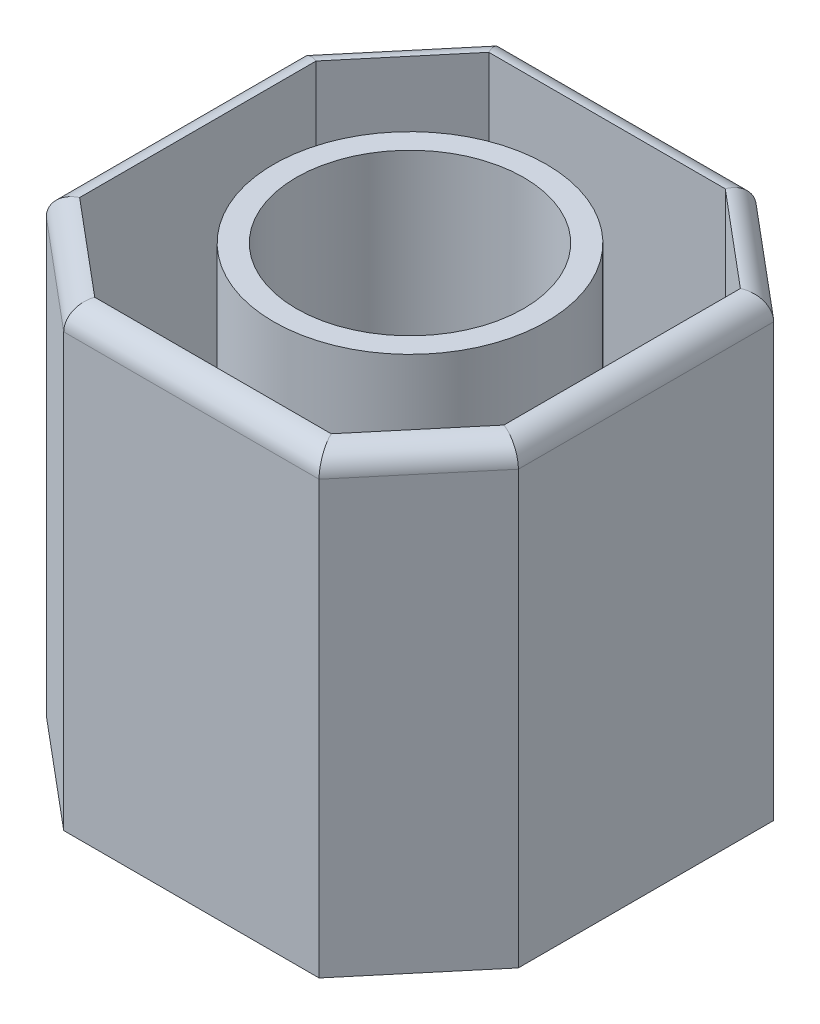
ISO-10303-21;
HEADER;
FILE_DESCRIPTION(('STEP AP214'),'2;1');
FILE_NAME('part.step','',(''),(''),'','','');
FILE_SCHEMA(('AUTOMOTIVE_DESIGN { 1 0 10303 214 1 1 1 1 }'));
ENDSEC;
DATA;
#1=APPLICATION_CONTEXT('core data for automotive mechanical design processes');
#2=APPLICATION_PROTOCOL_DEFINITION('international standard','automotive_design',2000,#1);
#3=PRODUCT_CONTEXT('',#1,'mechanical');
#4=PRODUCT('Part','Part','',(#3));
#5=PRODUCT_RELATED_PRODUCT_CATEGORY('part','',(#4));
#6=PRODUCT_DEFINITION_FORMATION('','',#4);
#7=PRODUCT_DEFINITION_CONTEXT('part definition',#1,'design');
#8=PRODUCT_DEFINITION('design','',#6,#7);
#9=PRODUCT_DEFINITION_SHAPE('','',#8);
#10=(LENGTH_UNIT() NAMED_UNIT(*) SI_UNIT(.MILLI.,.METRE.));
#11=(NAMED_UNIT(*) PLANE_ANGLE_UNIT() SI_UNIT($,.RADIAN.));
#12=(NAMED_UNIT(*) SI_UNIT($,.STERADIAN.) SOLID_ANGLE_UNIT());
#13=UNCERTAINTY_MEASURE_WITH_UNIT(LENGTH_MEASURE(1.E-05),#10,'distance_accuracy_value','');
#14=(GEOMETRIC_REPRESENTATION_CONTEXT(3) GLOBAL_UNCERTAINTY_ASSIGNED_CONTEXT((#13)) GLOBAL_UNIT_ASSIGNED_CONTEXT((#10,
#11,#12)) REPRESENTATION_CONTEXT('',''));
#15=CARTESIAN_POINT('',(0.,0.,0.));
#16=DIRECTION('',(0.,0.,1.));
#17=DIRECTION('',(1.,0.,0.));
#18=AXIS2_PLACEMENT_3D('',#15,#16,#17);
#19=CARTESIAN_POINT('',(0.,10.,0.));
#20=DIRECTION('',(0.,1.,0.));
#21=DIRECTION('',(0.,0.,1.));
#22=AXIS2_PLACEMENT_3D('',#19,#20,#21);
#23=PLANE('',#22);
#24=CARTESIAN_POINT('',(0.,10.,0.));
#25=DIRECTION('',(0.,1.,0.));
#26=DIRECTION('',(0.,0.,1.));
#27=AXIS2_PLACEMENT_3D('',#24,#25,#26);
#28=CIRCLE('',#27,2.5);
#29=CARTESIAN_POINT('',(0.,10.,2.5));
#30=VERTEX_POINT('',#29);
#31=EDGE_CURVE('E218',#30,#30,#28,.T.);
#32=ORIENTED_EDGE('',*,*,#31,.F.);
#33=EDGE_LOOP('',(#32));
#34=FACE_BOUND('',#33,.T.);
#35=CARTESIAN_POINT('',(0.,10.,0.));
#36=DIRECTION('',(0.,1.,0.));
#37=DIRECTION('',(0.,0.,1.));
#38=AXIS2_PLACEMENT_3D('',#35,#36,#37);
#39=CIRCLE('',#38,3.);
#40=CARTESIAN_POINT('',(0.,10.,3.));
#41=VERTEX_POINT('',#40);
#42=EDGE_CURVE('E213',#41,#41,#39,.T.);
#43=ORIENTED_EDGE('',*,*,#42,.T.);
#44=EDGE_LOOP('',(#43));
#45=FACE_BOUND('',#44,.T.);
#46=ADVANCED_FACE('F35',(#34,#45),#23,.T.);
#47=CARTESIAN_POINT('',(0.,0.,0.));
#48=DIRECTION('',(0.,1.,0.));
#49=DIRECTION('',(0.,0.,1.));
#50=AXIS2_PLACEMENT_3D('',#47,#48,#49);
#51=PLANE('',#50);
#52=DIRECTION('',(0.,0.,1.));
#53=VECTOR('',#52,1.);
#54=CARTESIAN_POINT('',(-5.,0.,5.));
#55=LINE('',#54,#53);
#56=CARTESIAN_POINT('',(-5.,0.,-2.61649281481158));
#57=VERTEX_POINT('',#56);
#58=CARTESIAN_POINT('',(-5.,0.,2.99999999999999));
#59=VERTEX_POINT('',#58);
#60=EDGE_CURVE('E221',#57,#59,#55,.T.);
#61=ORIENTED_EDGE('',*,*,#60,.F.);
#62=DIRECTION('',(-0.642787609686541,0.,0.766044443118977));
#63=VECTOR('',#62,1.);
#64=CARTESIAN_POINT('',(-5.,0.,-2.61649281481158));
#65=LINE('',#64,#63);
#66=CARTESIAN_POINT('',(-2.99999999999999,0.,-5.));
#67=VERTEX_POINT('',#66);
#68=EDGE_CURVE('E245',#57,#67,#65,.F.);
#69=ORIENTED_EDGE('',*,*,#68,.T.);
#70=DIRECTION('',(-1.,0.,0.));
#71=VECTOR('',#70,1.);
#72=CARTESIAN_POINT('',(5.,0.,-5.));
#73=LINE('',#72,#71);
#74=CARTESIAN_POINT('',(2.61649281481158,0.,-5.));
#75=VERTEX_POINT('',#74);
#76=EDGE_CURVE('E232',#75,#67,#73,.T.);
#77=ORIENTED_EDGE('',*,*,#76,.F.);
#78=DIRECTION('',(-0.766044443118977,0.,-0.642787609686541));
#79=VECTOR('',#78,1.);
#80=CARTESIAN_POINT('',(2.61649281481158,0.,-5.));
#81=LINE('',#80,#79);
#82=CARTESIAN_POINT('',(5.,0.,-2.99999999999999));
#83=VERTEX_POINT('',#82);
#84=EDGE_CURVE('E243',#75,#83,#81,.F.);
#85=ORIENTED_EDGE('',*,*,#84,.T.);
#86=DIRECTION('',(0.,0.,-1.));
#87=VECTOR('',#86,1.);
#88=CARTESIAN_POINT('',(5.,0.,5.));
#89=LINE('',#88,#87);
#90=CARTESIAN_POINT('',(5.,0.,2.61649281481158));
#91=VERTEX_POINT('',#90);
#92=EDGE_CURVE('E229',#91,#83,#89,.T.);
#93=ORIENTED_EDGE('',*,*,#92,.F.);
#94=DIRECTION('',(0.642787609686541,0.,-0.766044443118977));
#95=VECTOR('',#94,1.);
#96=CARTESIAN_POINT('',(5.,0.,2.61649281481158));
#97=LINE('',#96,#95);
#98=CARTESIAN_POINT('',(2.99999999999999,0.,5.));
#99=VERTEX_POINT('',#98);
#100=EDGE_CURVE('E241',#91,#99,#97,.F.);
#101=ORIENTED_EDGE('',*,*,#100,.T.);
#102=DIRECTION('',(1.,0.,0.));
#103=VECTOR('',#102,1.);
#104=CARTESIAN_POINT('',(5.,0.,5.));
#105=LINE('',#104,#103);
#106=CARTESIAN_POINT('',(-2.61649281481158,0.,5.));
#107=VERTEX_POINT('',#106);
#108=EDGE_CURVE('E226',#107,#99,#105,.T.);
#109=ORIENTED_EDGE('',*,*,#108,.F.);
#110=DIRECTION('',(0.766044443118977,0.,0.642787609686541));
#111=VECTOR('',#110,1.);
#112=CARTESIAN_POINT('',(-2.61649281481158,0.,5.));
#113=LINE('',#112,#111);
#114=EDGE_CURVE('E239',#107,#59,#113,.F.);
#115=ORIENTED_EDGE('',*,*,#114,.T.);
#116=EDGE_LOOP('',(#61,#69,#77,#85,#93,#101,#109,#115));
#117=FACE_BOUND('',#116,.T.);
#118=CARTESIAN_POINT('',(0.,0.,0.));
#119=DIRECTION('',(0.,1.,0.));
#120=DIRECTION('',(0.,0.,1.));
#121=AXIS2_PLACEMENT_3D('',#118,#119,#120);
#122=CIRCLE('',#121,2.5);
#123=CARTESIAN_POINT('',(0.,0.,2.5));
#124=VERTEX_POINT('',#123);
#125=EDGE_CURVE('E197',#124,#124,#122,.T.);
#126=ORIENTED_EDGE('',*,*,#125,.T.);
#127=EDGE_LOOP('',(#126));
#128=FACE_BOUND('',#127,.T.);
#129=ADVANCED_FACE('F365',(#117,#128),#51,.F.);
#130=CARTESIAN_POINT('',(-5.,10.,5.));
#131=DIRECTION('',(1.,0.,0.));
#132=DIRECTION('',(0.,0.,-1.));
#133=AXIS2_PLACEMENT_3D('',#130,#131,#132);
#134=PLANE('',#133);
#135=DIRECTION('',(0.,1.,0.));
#136=VECTOR('',#135,1.);
#137=CARTESIAN_POINT('',(-5.,10.,2.99999999999999));
#138=LINE('',#137,#136);
#139=CARTESIAN_POINT('',(-5.,9.5,2.99999999999999));
#140=VERTEX_POINT('',#139);
#141=EDGE_CURVE('E235',#59,#140,#138,.T.);
#142=ORIENTED_EDGE('',*,*,#141,.T.);
#143=DIRECTION('',(0.,0.,1.));
#144=VECTOR('',#143,1.);
#145=CARTESIAN_POINT('',(-5.,9.5,-2.61649281481158));
#146=LINE('',#145,#144);
#147=CARTESIAN_POINT('',(-5.,9.5,-2.61649281481158));
#148=VERTEX_POINT('',#147);
#149=EDGE_CURVE('E59',#140,#148,#146,.F.);
#150=ORIENTED_EDGE('',*,*,#149,.T.);
#151=DIRECTION('',(0.,-1.,0.));
#152=VECTOR('',#151,1.);
#153=CARTESIAN_POINT('',(-5.,10.,-2.61649281481158));
#154=LINE('',#153,#152);
#155=EDGE_CURVE('E237',#148,#57,#154,.T.);
#156=ORIENTED_EDGE('',*,*,#155,.T.);
#157=ORIENTED_EDGE('',*,*,#60,.T.);
#158=EDGE_LOOP('',(#142,#150,#156,#157));
#159=FACE_BOUND('',#158,.T.);
#160=ADVANCED_FACE('F371',(#159),#134,.F.);
#161=CARTESIAN_POINT('',(5.,10.,5.));
#162=DIRECTION('',(0.,0.,-1.));
#163=DIRECTION('',(-1.,0.,0.));
#164=AXIS2_PLACEMENT_3D('',#161,#162,#163);
#165=PLANE('',#164);
#166=DIRECTION('',(0.,1.,0.));
#167=VECTOR('',#166,1.);
#168=CARTESIAN_POINT('',(2.99999999999999,10.,5.));
#169=LINE('',#168,#167);
#170=CARTESIAN_POINT('',(2.99999999999999,9.5,5.));
#171=VERTEX_POINT('',#170);
#172=EDGE_CURVE('E258',#99,#171,#169,.T.);
#173=ORIENTED_EDGE('',*,*,#172,.T.);
#174=DIRECTION('',(1.,0.,0.));
#175=VECTOR('',#174,1.);
#176=CARTESIAN_POINT('',(-2.61649281481158,9.5,5.));
#177=LINE('',#176,#175);
#178=CARTESIAN_POINT('',(-2.61649281481158,9.5,5.));
#179=VERTEX_POINT('',#178);
#180=EDGE_CURVE('E268',#171,#179,#177,.F.);
#181=ORIENTED_EDGE('',*,*,#180,.T.);
#182=DIRECTION('',(0.,-1.,0.));
#183=VECTOR('',#182,1.);
#184=CARTESIAN_POINT('',(-2.61649281481158,10.,5.));
#185=LINE('',#184,#183);
#186=EDGE_CURVE('E256',#179,#107,#185,.T.);
#187=ORIENTED_EDGE('',*,*,#186,.T.);
#188=ORIENTED_EDGE('',*,*,#108,.T.);
#189=EDGE_LOOP('',(#173,#181,#187,#188));
#190=FACE_BOUND('',#189,.T.);
#191=ADVANCED_FACE('F387',(#190),#165,.F.);
#192=CARTESIAN_POINT('',(5.,10.,5.));
#193=DIRECTION('',(-1.,0.,0.));
#194=DIRECTION('',(0.,0.,1.));
#195=AXIS2_PLACEMENT_3D('',#192,#193,#194);
#196=PLANE('',#195);
#197=DIRECTION('',(0.,1.,0.));
#198=VECTOR('',#197,1.);
#199=CARTESIAN_POINT('',(5.,10.,-2.99999999999999));
#200=LINE('',#199,#198);
#201=CARTESIAN_POINT('',(5.,9.5,-2.99999999999999));
#202=VERTEX_POINT('',#201);
#203=EDGE_CURVE('E253',#83,#202,#200,.T.);
#204=ORIENTED_EDGE('',*,*,#203,.T.);
#205=DIRECTION('',(0.,0.,-1.));
#206=VECTOR('',#205,1.);
#207=CARTESIAN_POINT('',(5.,9.5,2.61649281481158));
#208=LINE('',#207,#206);
#209=CARTESIAN_POINT('',(5.,9.5,2.61649281481158));
#210=VERTEX_POINT('',#209);
#211=EDGE_CURVE('E264',#202,#210,#208,.F.);
#212=ORIENTED_EDGE('',*,*,#211,.T.);
#213=DIRECTION('',(0.,-1.,0.));
#214=VECTOR('',#213,1.);
#215=CARTESIAN_POINT('',(5.,10.,2.61649281481158));
#216=LINE('',#215,#214);
#217=EDGE_CURVE('E251',#210,#91,#216,.T.);
#218=ORIENTED_EDGE('',*,*,#217,.T.);
#219=ORIENTED_EDGE('',*,*,#92,.T.);
#220=EDGE_LOOP('',(#204,#212,#218,#219));
#221=FACE_BOUND('',#220,.T.);
#222=ADVANCED_FACE('F383',(#221),#196,.F.);
#223=CARTESIAN_POINT('',(5.,10.,-5.));
#224=DIRECTION('',(0.,0.,1.));
#225=DIRECTION('',(1.,0.,0.));
#226=AXIS2_PLACEMENT_3D('',#223,#224,#225);
#227=PLANE('',#226);
#228=DIRECTION('',(0.,1.,0.));
#229=VECTOR('',#228,1.);
#230=CARTESIAN_POINT('',(-2.99999999999999,10.,-5.));
#231=LINE('',#230,#229);
#232=CARTESIAN_POINT('',(-2.99999999999999,9.5,-5.));
#233=VERTEX_POINT('',#232);
#234=EDGE_CURVE('E249',#67,#233,#231,.T.);
#235=ORIENTED_EDGE('',*,*,#234,.T.);
#236=DIRECTION('',(-1.,0.,0.));
#237=VECTOR('',#236,1.);
#238=CARTESIAN_POINT('',(2.61649281481158,9.5,-5.));
#239=LINE('',#238,#237);
#240=CARTESIAN_POINT('',(2.61649281481158,9.5,-5.));
#241=VERTEX_POINT('',#240);
#242=EDGE_CURVE('E11',#233,#241,#239,.F.);
#243=ORIENTED_EDGE('',*,*,#242,.T.);
#244=DIRECTION('',(0.,-1.,0.));
#245=VECTOR('',#244,1.);
#246=CARTESIAN_POINT('',(2.61649281481158,10.,-5.));
#247=LINE('',#246,#245);
#248=EDGE_CURVE('E247',#241,#75,#247,.T.);
#249=ORIENTED_EDGE('',*,*,#248,.T.);
#250=ORIENTED_EDGE('',*,*,#76,.T.);
#251=EDGE_LOOP('',(#235,#243,#249,#250));
#252=FACE_BOUND('',#251,.T.);
#253=ADVANCED_FACE('F380',(#252),#227,.F.);
#254=CARTESIAN_POINT('',(0.,10.,0.));
#255=DIRECTION('',(0.,-1.,0.));
#256=DIRECTION('',(0.,0.,-1.));
#257=AXIS2_PLACEMENT_3D('',#254,#255,#256);
#258=CYLINDRICAL_SURFACE('',#257,2.5);
#259=ORIENTED_EDGE('',*,*,#31,.T.);
#260=EDGE_LOOP('',(#259));
#261=FACE_BOUND('',#260,.T.);
#262=ORIENTED_EDGE('',*,*,#125,.F.);
#263=EDGE_LOOP('',(#262));
#264=FACE_BOUND('',#263,.T.);
#265=ADVANCED_FACE('F377',(#261,#264),#258,.F.);
#266=CARTESIAN_POINT('',(-5.,10.,-2.61649281481158));
#267=DIRECTION('',(0.766044443118977,0.,0.642787609686541));
#268=DIRECTION('',(0.,-1.,0.));
#269=AXIS2_PLACEMENT_3D('',#266,#267,#268);
#270=PLANE('',#269);
#271=ORIENTED_EDGE('',*,*,#155,.F.);
#272=DIRECTION('',(-0.642787609686541,0.,0.766044443118977));
#273=VECTOR('',#272,1.);
#274=CARTESIAN_POINT('',(-5.,9.5,-2.61649281481158));
#275=LINE('',#274,#273);
#276=EDGE_CURVE('E44',#148,#233,#275,.F.);
#277=ORIENTED_EDGE('',*,*,#276,.T.);
#278=ORIENTED_EDGE('',*,*,#234,.F.);
#279=ORIENTED_EDGE('',*,*,#68,.F.);
#280=EDGE_LOOP('',(#271,#277,#278,#279));
#281=FACE_BOUND('',#280,.T.);
#282=ADVANCED_FACE('F394',(#281),#270,.F.);
#283=CARTESIAN_POINT('',(2.61649281481158,10.,-5.));
#284=DIRECTION('',(-0.642787609686541,0.,0.766044443118977));
#285=DIRECTION('',(0.,-1.,0.));
#286=AXIS2_PLACEMENT_3D('',#283,#284,#285);
#287=PLANE('',#286);
#288=ORIENTED_EDGE('',*,*,#248,.F.);
#289=DIRECTION('',(-0.766044443118977,0.,-0.642787609686541));
#290=VECTOR('',#289,1.);
#291=CARTESIAN_POINT('',(2.61649281481158,9.5,-5.));
#292=LINE('',#291,#290);
#293=EDGE_CURVE('E261',#241,#202,#292,.F.);
#294=ORIENTED_EDGE('',*,*,#293,.T.);
#295=ORIENTED_EDGE('',*,*,#203,.F.);
#296=ORIENTED_EDGE('',*,*,#84,.F.);
#297=EDGE_LOOP('',(#288,#294,#295,#296));
#298=FACE_BOUND('',#297,.T.);
#299=ADVANCED_FACE('F397',(#298),#287,.F.);
#300=CARTESIAN_POINT('',(5.,10.,2.61649281481158));
#301=DIRECTION('',(-0.766044443118977,0.,-0.642787609686541));
#302=DIRECTION('',(0.,-1.,0.));
#303=AXIS2_PLACEMENT_3D('',#300,#301,#302);
#304=PLANE('',#303);
#305=ORIENTED_EDGE('',*,*,#217,.F.);
#306=DIRECTION('',(0.642787609686541,0.,-0.766044443118977));
#307=VECTOR('',#306,1.);
#308=CARTESIAN_POINT('',(5.,9.5,2.61649281481158));
#309=LINE('',#308,#307);
#310=EDGE_CURVE('E266',#210,#171,#309,.F.);
#311=ORIENTED_EDGE('',*,*,#310,.T.);
#312=ORIENTED_EDGE('',*,*,#172,.F.);
#313=ORIENTED_EDGE('',*,*,#100,.F.);
#314=EDGE_LOOP('',(#305,#311,#312,#313));
#315=FACE_BOUND('',#314,.T.);
#316=ADVANCED_FACE('F400',(#315),#304,.F.);
#317=CARTESIAN_POINT('',(-2.61649281481158,10.,5.));
#318=DIRECTION('',(0.642787609686541,0.,-0.766044443118977));
#319=DIRECTION('',(0.,-1.,0.));
#320=AXIS2_PLACEMENT_3D('',#317,#318,#319);
#321=PLANE('',#320);
#322=ORIENTED_EDGE('',*,*,#186,.F.);
#323=DIRECTION('',(0.766044443118977,0.,0.642787609686541));
#324=VECTOR('',#323,1.);
#325=CARTESIAN_POINT('',(-2.61649281481158,9.5,5.));
#326=LINE('',#325,#324);
#327=EDGE_CURVE('E270',#179,#140,#326,.F.);
#328=ORIENTED_EDGE('',*,*,#327,.T.);
#329=ORIENTED_EDGE('',*,*,#141,.F.);
#330=ORIENTED_EDGE('',*,*,#114,.F.);
#331=EDGE_LOOP('',(#322,#328,#329,#330));
#332=FACE_BOUND('',#331,.T.);
#333=ADVANCED_FACE('F404',(#332),#321,.F.);
#334=CARTESIAN_POINT('',(0.,0.5,0.));
#335=DIRECTION('',(0.,1.,0.));
#336=DIRECTION('',(0.,0.,1.));
#337=AXIS2_PLACEMENT_3D('',#334,#335,#336);
#338=PLANE('',#337);
#339=DIRECTION('',(0.,0.,1.));
#340=VECTOR('',#339,1.);
#341=CARTESIAN_POINT('',(-4.5,0.5,5.));
#342=LINE('',#341,#340);
#343=CARTESIAN_POINT('',(-4.5,0.5,-2.43450769767848));
#344=VERTEX_POINT('',#343);
#345=CARTESIAN_POINT('',(-4.5,0.5,2.76684617092249));
#346=VERTEX_POINT('',#345);
#347=EDGE_CURVE('E216',#344,#346,#342,.T.);
#348=ORIENTED_EDGE('',*,*,#347,.T.);
#349=DIRECTION('',(0.766044443118977,0.,0.642787609686541));
#350=VECTOR('',#349,1.);
#351=CARTESIAN_POINT('',(-2.29509900996831,0.5,4.61697777844051));
#352=LINE('',#351,#350);
#353=CARTESIAN_POINT('',(-2.43450769767848,0.5,4.5));
#354=VERTEX_POINT('',#353);
#355=EDGE_CURVE('E304',#354,#346,#352,.F.);
#356=ORIENTED_EDGE('',*,*,#355,.F.);
#357=DIRECTION('',(1.,0.,0.));
#358=VECTOR('',#357,1.);
#359=CARTESIAN_POINT('',(5.,0.5,4.5));
#360=LINE('',#359,#358);
#361=CARTESIAN_POINT('',(2.76684617092249,0.5,4.5));
#362=VERTEX_POINT('',#361);
#363=EDGE_CURVE('E325',#354,#362,#360,.T.);
#364=ORIENTED_EDGE('',*,*,#363,.T.);
#365=DIRECTION('',(0.642787609686541,0.,-0.766044443118977));
#366=VECTOR('',#365,1.);
#367=CARTESIAN_POINT('',(4.61697777844051,0.5,2.29509900996831));
#368=LINE('',#367,#366);
#369=CARTESIAN_POINT('',(4.5,0.5,2.43450769767848));
#370=VERTEX_POINT('',#369);
#371=EDGE_CURVE('E306',#370,#362,#368,.F.);
#372=ORIENTED_EDGE('',*,*,#371,.F.);
#373=DIRECTION('',(0.,0.,-1.));
#374=VECTOR('',#373,1.);
#375=CARTESIAN_POINT('',(4.5,0.5,5.));
#376=LINE('',#375,#374);
#377=CARTESIAN_POINT('',(4.5,0.5,-2.76684617092249));
#378=VERTEX_POINT('',#377);
#379=EDGE_CURVE('E172',#370,#378,#376,.T.);
#380=ORIENTED_EDGE('',*,*,#379,.T.);
#381=DIRECTION('',(-0.766044443118977,0.,-0.642787609686541));
#382=VECTOR('',#381,1.);
#383=CARTESIAN_POINT('',(2.29509900996831,0.5,-4.61697777844051));
#384=LINE('',#383,#382);
#385=CARTESIAN_POINT('',(2.43450769767848,0.5,-4.5));
#386=VERTEX_POINT('',#385);
#387=EDGE_CURVE('E161',#386,#378,#384,.F.);
#388=ORIENTED_EDGE('',*,*,#387,.F.);
#389=DIRECTION('',(-1.,0.,0.));
#390=VECTOR('',#389,1.);
#391=CARTESIAN_POINT('',(5.,0.5,-4.5));
#392=LINE('',#391,#390);
#393=CARTESIAN_POINT('',(-2.7668461709225,0.5,-4.5));
#394=VERTEX_POINT('',#393);
#395=EDGE_CURVE('E164',#386,#394,#392,.T.);
#396=ORIENTED_EDGE('',*,*,#395,.T.);
#397=DIRECTION('',(-0.642787609686541,0.,0.766044443118977));
#398=VECTOR('',#397,1.);
#399=CARTESIAN_POINT('',(-4.61697777844051,0.5,-2.29509900996831));
#400=LINE('',#399,#398);
#401=EDGE_CURVE('E149',#344,#394,#400,.F.);
#402=ORIENTED_EDGE('',*,*,#401,.F.);
#403=EDGE_LOOP('',(#348,#356,#364,#372,#380,#388,#396,#402));
#404=FACE_BOUND('',#403,.T.);
#405=CARTESIAN_POINT('',(0.,0.5,0.));
#406=DIRECTION('',(0.,1.,0.));
#407=DIRECTION('',(0.,0.,1.));
#408=AXIS2_PLACEMENT_3D('',#405,#406,#407);
#409=CIRCLE('',#408,3.);
#410=CARTESIAN_POINT('',(0.,0.5,3.));
#411=VERTEX_POINT('',#410);
#412=EDGE_CURVE('E217',#411,#411,#409,.T.);
#413=ORIENTED_EDGE('',*,*,#412,.F.);
#414=EDGE_LOOP('',(#413));
#415=FACE_BOUND('',#414,.T.);
#416=ADVANCED_FACE('F165',(#404,#415),#338,.T.);
#417=CARTESIAN_POINT('',(-4.5,10.,5.));
#418=DIRECTION('',(1.,0.,0.));
#419=DIRECTION('',(0.,0.,-1.));
#420=AXIS2_PLACEMENT_3D('',#417,#418,#419);
#421=PLANE('',#420);
#422=DIRECTION('',(0.,0.,1.));
#423=VECTOR('',#422,1.);
#424=CARTESIAN_POINT('',(-4.5,10.,5.));
#425=LINE('',#424,#423);
#426=CARTESIAN_POINT('',(-4.5,10.,-2.43450769767848));
#427=VERTEX_POINT('',#426);
#428=CARTESIAN_POINT('',(-4.5,10.,2.76684617092249));
#429=VERTEX_POINT('',#428);
#430=EDGE_CURVE('E171',#427,#429,#425,.T.);
#431=ORIENTED_EDGE('',*,*,#430,.T.);
#432=DIRECTION('',(0.,-1.,0.));
#433=VECTOR('',#432,1.);
#434=CARTESIAN_POINT('',(-4.5,10.,2.76684617092249));
#435=LINE('',#434,#433);
#436=EDGE_CURVE('E184',#346,#429,#435,.F.);
#437=ORIENTED_EDGE('',*,*,#436,.F.);
#438=ORIENTED_EDGE('',*,*,#347,.F.);
#439=DIRECTION('',(0.,1.,0.));
#440=VECTOR('',#439,1.);
#441=CARTESIAN_POINT('',(-4.5,10.,-2.43450769767848));
#442=LINE('',#441,#440);
#443=EDGE_CURVE('E156',#427,#344,#442,.F.);
#444=ORIENTED_EDGE('',*,*,#443,.F.);
#445=EDGE_LOOP('',(#431,#437,#438,#444));
#446=FACE_BOUND('',#445,.T.);
#447=ADVANCED_FACE('F313',(#446),#421,.T.);
#448=CARTESIAN_POINT('',(5.,10.,4.5));
#449=DIRECTION('',(0.,0.,-1.));
#450=DIRECTION('',(-1.,0.,0.));
#451=AXIS2_PLACEMENT_3D('',#448,#449,#450);
#452=PLANE('',#451);
#453=ORIENTED_EDGE('',*,*,#363,.F.);
#454=DIRECTION('',(0.,1.,0.));
#455=VECTOR('',#454,1.);
#456=CARTESIAN_POINT('',(-2.43450769767848,10.,4.5));
#457=LINE('',#456,#455);
#458=CARTESIAN_POINT('',(-2.43450769767848,10.,4.5));
#459=VERTEX_POINT('',#458);
#460=EDGE_CURVE('E190',#459,#354,#457,.F.);
#461=ORIENTED_EDGE('',*,*,#460,.F.);
#462=DIRECTION('',(1.,0.,0.));
#463=VECTOR('',#462,1.);
#464=CARTESIAN_POINT('',(5.,10.,4.5));
#465=LINE('',#464,#463);
#466=CARTESIAN_POINT('',(2.76684617092249,10.,4.5));
#467=VERTEX_POINT('',#466);
#468=EDGE_CURVE('E201',#459,#467,#465,.T.);
#469=ORIENTED_EDGE('',*,*,#468,.T.);
#470=DIRECTION('',(0.,-1.,0.));
#471=VECTOR('',#470,1.);
#472=CARTESIAN_POINT('',(2.76684617092249,10.,4.5));
#473=LINE('',#472,#471);
#474=EDGE_CURVE('E195',#362,#467,#473,.F.);
#475=ORIENTED_EDGE('',*,*,#474,.F.);
#476=EDGE_LOOP('',(#453,#461,#469,#475));
#477=FACE_BOUND('',#476,.T.);
#478=ADVANCED_FACE('F323',(#477),#452,.T.);
#479=CARTESIAN_POINT('',(4.5,10.,5.));
#480=DIRECTION('',(-1.,0.,0.));
#481=DIRECTION('',(0.,0.,1.));
#482=AXIS2_PLACEMENT_3D('',#479,#480,#481);
#483=PLANE('',#482);
#484=ORIENTED_EDGE('',*,*,#379,.F.);
#485=DIRECTION('',(0.,1.,0.));
#486=VECTOR('',#485,1.);
#487=CARTESIAN_POINT('',(4.5,10.,2.43450769767848));
#488=LINE('',#487,#486);
#489=CARTESIAN_POINT('',(4.5,10.,2.43450769767848));
#490=VERTEX_POINT('',#489);
#491=EDGE_CURVE('E191',#490,#370,#488,.F.);
#492=ORIENTED_EDGE('',*,*,#491,.F.);
#493=DIRECTION('',(0.,0.,-1.));
#494=VECTOR('',#493,1.);
#495=CARTESIAN_POINT('',(4.5,10.,5.));
#496=LINE('',#495,#494);
#497=CARTESIAN_POINT('',(4.5,10.,-2.76684617092249));
#498=VERTEX_POINT('',#497);
#499=EDGE_CURVE('E205',#490,#498,#496,.T.);
#500=ORIENTED_EDGE('',*,*,#499,.T.);
#501=DIRECTION('',(0.,-1.,0.));
#502=VECTOR('',#501,1.);
#503=CARTESIAN_POINT('',(4.5,10.,-2.76684617092249));
#504=LINE('',#503,#502);
#505=EDGE_CURVE('E187',#378,#498,#504,.F.);
#506=ORIENTED_EDGE('',*,*,#505,.F.);
#507=EDGE_LOOP('',(#484,#492,#500,#506));
#508=FACE_BOUND('',#507,.T.);
#509=ADVANCED_FACE('F337',(#508),#483,.T.);
#510=CARTESIAN_POINT('',(5.,10.,-4.5));
#511=DIRECTION('',(0.,0.,1.));
#512=DIRECTION('',(1.,0.,0.));
#513=AXIS2_PLACEMENT_3D('',#510,#511,#512);
#514=PLANE('',#513);
#515=ORIENTED_EDGE('',*,*,#395,.F.);
#516=DIRECTION('',(0.,1.,0.));
#517=VECTOR('',#516,1.);
#518=CARTESIAN_POINT('',(2.43450769767848,10.,-4.5));
#519=LINE('',#518,#517);
#520=CARTESIAN_POINT('',(2.43450769767848,10.,-4.5));
#521=VERTEX_POINT('',#520);
#522=EDGE_CURVE('E160',#521,#386,#519,.F.);
#523=ORIENTED_EDGE('',*,*,#522,.F.);
#524=DIRECTION('',(-1.,0.,0.));
#525=VECTOR('',#524,1.);
#526=CARTESIAN_POINT('',(5.,10.,-4.5));
#527=LINE('',#526,#525);
#528=CARTESIAN_POINT('',(-2.7668461709225,10.,-4.5));
#529=VERTEX_POINT('',#528);
#530=EDGE_CURVE('E176',#521,#529,#527,.T.);
#531=ORIENTED_EDGE('',*,*,#530,.T.);
#532=DIRECTION('',(0.,-1.,0.));
#533=VECTOR('',#532,1.);
#534=CARTESIAN_POINT('',(-2.76684617092249,10.,-4.5));
#535=LINE('',#534,#533);
#536=EDGE_CURVE('E153',#394,#529,#535,.F.);
#537=ORIENTED_EDGE('',*,*,#536,.F.);
#538=EDGE_LOOP('',(#515,#523,#531,#537));
#539=FACE_BOUND('',#538,.T.);
#540=ADVANCED_FACE('F174',(#539),#514,.T.);
#541=CARTESIAN_POINT('',(0.,10.,0.));
#542=DIRECTION('',(0.,-1.,0.));
#543=DIRECTION('',(0.,0.,-1.));
#544=AXIS2_PLACEMENT_3D('',#541,#542,#543);
#545=CYLINDRICAL_SURFACE('',#544,3.);
#546=ORIENTED_EDGE('',*,*,#42,.F.);
#547=EDGE_LOOP('',(#546));
#548=FACE_BOUND('',#547,.T.);
#549=ORIENTED_EDGE('',*,*,#412,.T.);
#550=EDGE_LOOP('',(#549));
#551=FACE_BOUND('',#550,.T.);
#552=ADVANCED_FACE('F489',(#548,#551),#545,.T.);
#553=CARTESIAN_POINT('',(-4.61697777844051,10.,-2.29509900996831));
#554=DIRECTION('',(0.766044443118977,0.,0.642787609686541));
#555=DIRECTION('',(0.,-1.,0.));
#556=AXIS2_PLACEMENT_3D('',#553,#554,#555);
#557=PLANE('',#556);
#558=DIRECTION('',(0.642787609686541,0.,-0.766044443118977));
#559=VECTOR('',#558,1.);
#560=CARTESIAN_POINT('',(-3.83946942747142,10.,-3.22169738050772));
#561=LINE('',#560,#559);
#562=EDGE_CURVE('E194',#529,#427,#561,.F.);
#563=ORIENTED_EDGE('',*,*,#562,.T.);
#564=ORIENTED_EDGE('',*,*,#443,.T.);
#565=ORIENTED_EDGE('',*,*,#401,.T.);
#566=ORIENTED_EDGE('',*,*,#536,.T.);
#567=EDGE_LOOP('',(#563,#564,#565,#566));
#568=FACE_BOUND('',#567,.T.);
#569=ADVANCED_FACE('F151',(#568),#557,.T.);
#570=CARTESIAN_POINT('',(2.29509900996831,10.,-4.61697777844051));
#571=DIRECTION('',(-0.642787609686541,0.,0.766044443118977));
#572=DIRECTION('',(0.,-1.,0.));
#573=AXIS2_PLACEMENT_3D('',#570,#571,#572);
#574=PLANE('',#573);
#575=DIRECTION('',(0.766044443118977,0.,0.642787609686541));
#576=VECTOR('',#575,1.);
#577=CARTESIAN_POINT('',(3.22169738050772,10.,-3.83946942747142));
#578=LINE('',#577,#576);
#579=EDGE_CURVE('E207',#498,#521,#578,.F.);
#580=ORIENTED_EDGE('',*,*,#579,.T.);
#581=ORIENTED_EDGE('',*,*,#522,.T.);
#582=ORIENTED_EDGE('',*,*,#387,.T.);
#583=ORIENTED_EDGE('',*,*,#505,.T.);
#584=EDGE_LOOP('',(#580,#581,#582,#583));
#585=FACE_BOUND('',#584,.T.);
#586=ADVANCED_FACE('F331',(#585),#574,.T.);
#587=CARTESIAN_POINT('',(4.61697777844051,10.,2.29509900996831));
#588=DIRECTION('',(-0.766044443118977,0.,-0.642787609686541));
#589=DIRECTION('',(0.,-1.,0.));
#590=AXIS2_PLACEMENT_3D('',#587,#588,#589);
#591=PLANE('',#590);
#592=DIRECTION('',(-0.642787609686541,0.,0.766044443118977));
#593=VECTOR('',#592,1.);
#594=CARTESIAN_POINT('',(3.83946942747142,10.,3.22169738050772));
#595=LINE('',#594,#593);
#596=EDGE_CURVE('E180',#467,#490,#595,.F.);
#597=ORIENTED_EDGE('',*,*,#596,.T.);
#598=ORIENTED_EDGE('',*,*,#491,.T.);
#599=ORIENTED_EDGE('',*,*,#371,.T.);
#600=ORIENTED_EDGE('',*,*,#474,.T.);
#601=EDGE_LOOP('',(#597,#598,#599,#600));
#602=FACE_BOUND('',#601,.T.);
#603=ADVANCED_FACE('F467',(#602),#591,.T.);
#604=CARTESIAN_POINT('',(-2.29509900996831,10.,4.61697777844051));
#605=DIRECTION('',(0.642787609686541,0.,-0.766044443118977));
#606=DIRECTION('',(0.,-1.,0.));
#607=AXIS2_PLACEMENT_3D('',#604,#605,#606);
#608=PLANE('',#607);
#609=DIRECTION('',(-0.766044443118977,0.,-0.642787609686541));
#610=VECTOR('',#609,1.);
#611=CARTESIAN_POINT('',(-3.22169738050772,10.,3.83946942747142));
#612=LINE('',#611,#610);
#613=EDGE_CURVE('E178',#429,#459,#612,.F.);
#614=ORIENTED_EDGE('',*,*,#613,.T.);
#615=ORIENTED_EDGE('',*,*,#460,.T.);
#616=ORIENTED_EDGE('',*,*,#355,.T.);
#617=ORIENTED_EDGE('',*,*,#436,.T.);
#618=EDGE_LOOP('',(#614,#615,#616,#617));
#619=FACE_BOUND('',#618,.T.);
#620=ADVANCED_FACE('F309',(#619),#608,.T.);
#621=CARTESIAN_POINT('',(-3.22169738050772,9.5,3.83946942747142));
#622=DIRECTION('',(-0.766044443118977,0.,-0.642787609686541));
#623=DIRECTION('',(-0.642787609686541,0.,0.766044443118977));
#624=AXIS2_PLACEMENT_3D('',#621,#622,#623);
#625=CYLINDRICAL_SURFACE('',#624,0.5);
#626=CARTESIAN_POINT('',(-4.5,9.5,2.76684617092249));
#627=DIRECTION('',(-0.422618261740699,0.,-0.90630778703665));
#628=DIRECTION('',(0.90630778703665,0.,-0.422618261740699));
#629=AXIS2_PLACEMENT_3D('',#626,#627,#628);
#630=ELLIPSE('',#629,0.551688959481246,0.5);
#631=EDGE_CURVE('E289',#140,#429,#630,.T.);
#632=ORIENTED_EDGE('',*,*,#631,.F.);
#633=ORIENTED_EDGE('',*,*,#327,.F.);
#634=CARTESIAN_POINT('',(-2.43450769767848,9.5,4.5));
#635=DIRECTION('',(-0.939692620785908,0.,-0.342020143325669));
#636=DIRECTION('',(0.34202014332567,0.,-0.939692620785908));
#637=AXIS2_PLACEMENT_3D('',#634,#635,#636);
#638=ELLIPSE('',#637,0.532088886237956,0.5);
#639=EDGE_CURVE('E39',#459,#179,#638,.F.);
#640=ORIENTED_EDGE('',*,*,#639,.F.);
#641=ORIENTED_EDGE('',*,*,#613,.F.);
#642=EDGE_LOOP('',(#632,#633,#640,#641));
#643=FACE_BOUND('',#642,.T.);
#644=ADVANCED_FACE('F37',(#643),#625,.T.);
#645=CARTESIAN_POINT('',(0.,9.5,4.5));
#646=DIRECTION('',(-1.,0.,0.));
#647=DIRECTION('',(0.,0.,1.));
#648=AXIS2_PLACEMENT_3D('',#645,#646,#647);
#649=CYLINDRICAL_SURFACE('',#648,0.5);
#650=ORIENTED_EDGE('',*,*,#639,.T.);
#651=ORIENTED_EDGE('',*,*,#180,.F.);
#652=CARTESIAN_POINT('',(2.76684617092249,9.5,4.5));
#653=DIRECTION('',(-0.90630778703665,0.,0.422618261740699));
#654=DIRECTION('',(-0.422618261740699,0.,-0.90630778703665));
#655=AXIS2_PLACEMENT_3D('',#652,#653,#654);
#656=ELLIPSE('',#655,0.551688959481246,0.5);
#657=EDGE_CURVE('E287',#467,#171,#656,.F.);
#658=ORIENTED_EDGE('',*,*,#657,.F.);
#659=ORIENTED_EDGE('',*,*,#468,.F.);
#660=EDGE_LOOP('',(#650,#651,#658,#659));
#661=FACE_BOUND('',#660,.T.);
#662=ADVANCED_FACE('F318',(#661),#649,.T.);
#663=CARTESIAN_POINT('',(-4.5,9.5,0.));
#664=DIRECTION('',(0.,0.,-1.));
#665=DIRECTION('',(-1.,0.,0.));
#666=AXIS2_PLACEMENT_3D('',#663,#664,#665);
#667=CYLINDRICAL_SURFACE('',#666,0.5);
#668=ORIENTED_EDGE('',*,*,#631,.T.);
#669=ORIENTED_EDGE('',*,*,#430,.F.);
#670=CARTESIAN_POINT('',(-4.5,9.5,-2.43450769767848));
#671=DIRECTION('',(0.342020143325669,0.,-0.939692620785908));
#672=DIRECTION('',(0.939692620785908,0.,0.342020143325669));
#673=AXIS2_PLACEMENT_3D('',#670,#671,#672);
#674=ELLIPSE('',#673,0.532088886237956,0.5);
#675=EDGE_CURVE('E284',#148,#427,#674,.T.);
#676=ORIENTED_EDGE('',*,*,#675,.F.);
#677=ORIENTED_EDGE('',*,*,#149,.F.);
#678=EDGE_LOOP('',(#668,#669,#676,#677));
#679=FACE_BOUND('',#678,.T.);
#680=ADVANCED_FACE('F354',(#679),#667,.T.);
#681=CARTESIAN_POINT('',(3.83946942747142,9.5,3.22169738050772));
#682=DIRECTION('',(-0.642787609686541,0.,0.766044443118977));
#683=DIRECTION('',(0.766044443118977,0.,0.642787609686541));
#684=AXIS2_PLACEMENT_3D('',#681,#682,#683);
#685=CYLINDRICAL_SURFACE('',#684,0.5);
#686=ORIENTED_EDGE('',*,*,#657,.T.);
#687=ORIENTED_EDGE('',*,*,#310,.F.);
#688=CARTESIAN_POINT('',(4.5,9.5,2.43450769767848));
#689=DIRECTION('',(-0.342020143325669,0.,0.939692620785908));
#690=DIRECTION('',(-0.939692620785908,0.,-0.34202014332567));
#691=AXIS2_PLACEMENT_3D('',#688,#689,#690);
#692=ELLIPSE('',#691,0.532088886237956,0.5);
#693=EDGE_CURVE('E281',#490,#210,#692,.F.);
#694=ORIENTED_EDGE('',*,*,#693,.F.);
#695=ORIENTED_EDGE('',*,*,#596,.F.);
#696=EDGE_LOOP('',(#686,#687,#694,#695));
#697=FACE_BOUND('',#696,.T.);
#698=ADVANCED_FACE('F356',(#697),#685,.T.);
#699=CARTESIAN_POINT('',(-3.83946942747142,9.5,-3.22169738050772));
#700=DIRECTION('',(0.642787609686541,0.,-0.766044443118977));
#701=DIRECTION('',(-0.766044443118977,0.,-0.642787609686541));
#702=AXIS2_PLACEMENT_3D('',#699,#700,#701);
#703=CYLINDRICAL_SURFACE('',#702,0.5);
#704=ORIENTED_EDGE('',*,*,#675,.T.);
#705=ORIENTED_EDGE('',*,*,#562,.F.);
#706=CARTESIAN_POINT('',(-2.76684617092249,9.5,-4.5));
#707=DIRECTION('',(0.90630778703665,0.,-0.422618261740699));
#708=DIRECTION('',(0.422618261740699,0.,0.90630778703665));
#709=AXIS2_PLACEMENT_3D('',#706,#707,#708);
#710=ELLIPSE('',#709,0.551688959481246,0.5);
#711=EDGE_CURVE('E278',#233,#529,#710,.T.);
#712=ORIENTED_EDGE('',*,*,#711,.F.);
#713=ORIENTED_EDGE('',*,*,#276,.F.);
#714=EDGE_LOOP('',(#704,#705,#712,#713));
#715=FACE_BOUND('',#714,.T.);
#716=ADVANCED_FACE('F353',(#715),#703,.T.);
#717=CARTESIAN_POINT('',(4.5,9.5,0.));
#718=DIRECTION('',(0.,0.,1.));
#719=DIRECTION('',(1.,0.,0.));
#720=AXIS2_PLACEMENT_3D('',#717,#718,#719);
#721=CYLINDRICAL_SURFACE('',#720,0.5);
#722=ORIENTED_EDGE('',*,*,#693,.T.);
#723=ORIENTED_EDGE('',*,*,#211,.F.);
#724=CARTESIAN_POINT('',(4.5,9.5,-2.76684617092249));
#725=DIRECTION('',(0.422618261740699,0.,0.90630778703665));
#726=DIRECTION('',(-0.90630778703665,0.,0.422618261740699));
#727=AXIS2_PLACEMENT_3D('',#724,#725,#726);
#728=ELLIPSE('',#727,0.551688959481246,0.5);
#729=EDGE_CURVE('E276',#498,#202,#728,.F.);
#730=ORIENTED_EDGE('',*,*,#729,.F.);
#731=ORIENTED_EDGE('',*,*,#499,.F.);
#732=EDGE_LOOP('',(#722,#723,#730,#731));
#733=FACE_BOUND('',#732,.T.);
#734=ADVANCED_FACE('F341',(#733),#721,.T.);
#735=CARTESIAN_POINT('',(0.,9.5,-4.5));
#736=DIRECTION('',(1.,0.,0.));
#737=DIRECTION('',(0.,0.,-1.));
#738=AXIS2_PLACEMENT_3D('',#735,#736,#737);
#739=CYLINDRICAL_SURFACE('',#738,0.5);
#740=ORIENTED_EDGE('',*,*,#711,.T.);
#741=ORIENTED_EDGE('',*,*,#530,.F.);
#742=CARTESIAN_POINT('',(2.43450769767848,9.5,-4.5));
#743=DIRECTION('',(0.939692620785908,0.,0.342020143325669));
#744=DIRECTION('',(0.34202014332567,0.,-0.939692620785908));
#745=AXIS2_PLACEMENT_3D('',#742,#743,#744);
#746=ELLIPSE('',#745,0.532088886237956,0.5);
#747=EDGE_CURVE('E274',#241,#521,#746,.T.);
#748=ORIENTED_EDGE('',*,*,#747,.F.);
#749=ORIENTED_EDGE('',*,*,#242,.F.);
#750=EDGE_LOOP('',(#740,#741,#748,#749));
#751=FACE_BOUND('',#750,.T.);
#752=ADVANCED_FACE('F350',(#751),#739,.T.);
#753=CARTESIAN_POINT('',(3.22169738050772,9.5,-3.83946942747142));
#754=DIRECTION('',(0.766044443118977,0.,0.642787609686541));
#755=DIRECTION('',(0.642787609686541,0.,-0.766044443118977));
#756=AXIS2_PLACEMENT_3D('',#753,#754,#755);
#757=CYLINDRICAL_SURFACE('',#756,0.5);
#758=ORIENTED_EDGE('',*,*,#729,.T.);
#759=ORIENTED_EDGE('',*,*,#293,.F.);
#760=ORIENTED_EDGE('',*,*,#747,.T.);
#761=ORIENTED_EDGE('',*,*,#579,.F.);
#762=EDGE_LOOP('',(#758,#759,#760,#761));
#763=FACE_BOUND('',#762,.T.);
#764=ADVANCED_FACE('F346',(#763),#757,.T.);
#765=CLOSED_SHELL('',(#46,#129,#160,#191,#222,#253,#265,#282,#299,#316,#333,#416,#447,#478,#509,
#540,#552,#569,#586,#603,#620,#644,#662,#680,#698,#716,#734,#752,#764));
#766=MANIFOLD_SOLID_BREP('B2',#765);
#767=ADVANCED_BREP_SHAPE_REPRESENTATION('',(#18,#766),#14);
#768=SHAPE_DEFINITION_REPRESENTATION(#9,#767);
ENDSEC;
END-ISO-10303-21;
